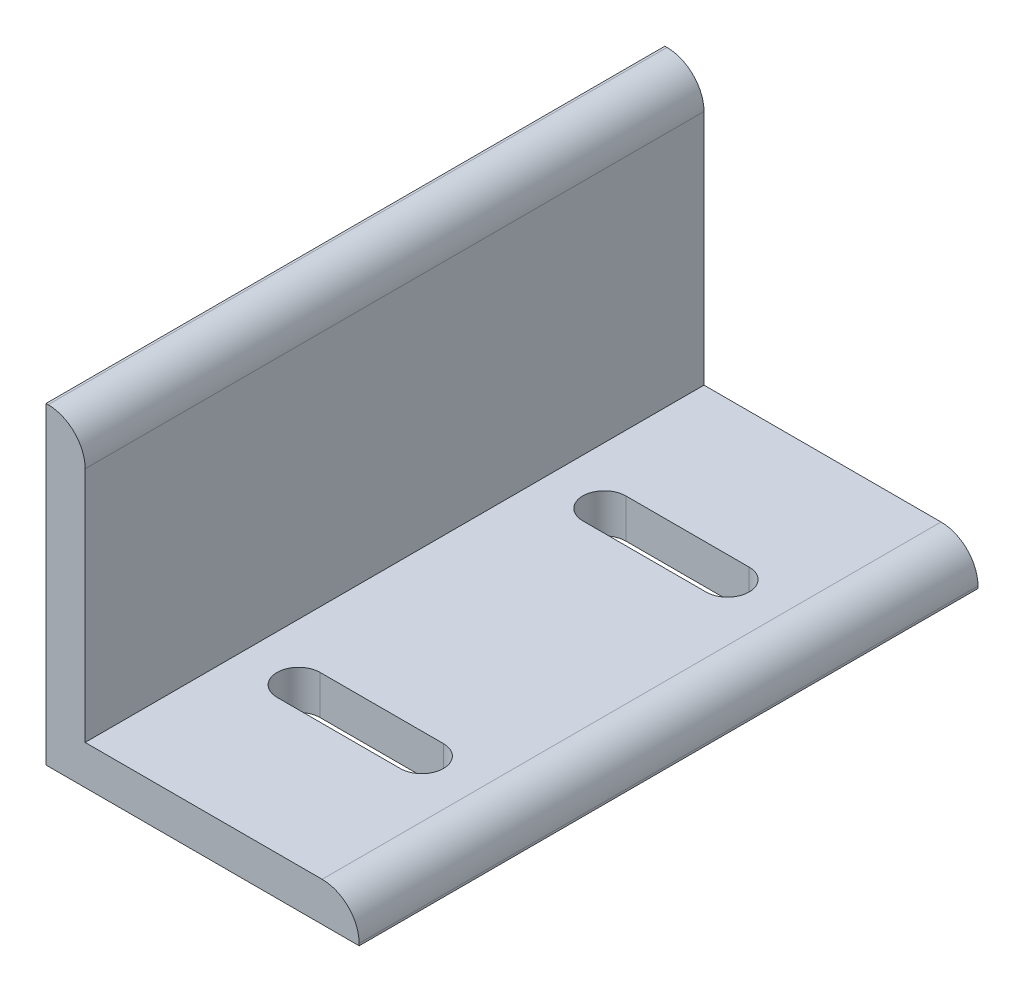
ISO-10303-21;
HEADER;
FILE_DESCRIPTION(('STEP AP214'),'2;1');
FILE_NAME('part.step','',(''),(''),'','','');
FILE_SCHEMA(('AUTOMOTIVE_DESIGN { 1 0 10303 214 1 1 1 1 }'));
ENDSEC;
DATA;
#1=APPLICATION_CONTEXT('core data for automotive mechanical design processes');
#2=APPLICATION_PROTOCOL_DEFINITION('international standard','automotive_design',2000,#1);
#3=PRODUCT_CONTEXT('',#1,'mechanical');
#4=PRODUCT('Part','Part','',(#3));
#5=PRODUCT_RELATED_PRODUCT_CATEGORY('part','',(#4));
#6=PRODUCT_DEFINITION_FORMATION('','',#4);
#7=PRODUCT_DEFINITION_CONTEXT('part definition',#1,'design');
#8=PRODUCT_DEFINITION('design','',#6,#7);
#9=PRODUCT_DEFINITION_SHAPE('','',#8);
#10=(LENGTH_UNIT() NAMED_UNIT(*) SI_UNIT(.MILLI.,.METRE.));
#11=(NAMED_UNIT(*) PLANE_ANGLE_UNIT() SI_UNIT($,.RADIAN.));
#12=(NAMED_UNIT(*) SI_UNIT($,.STERADIAN.) SOLID_ANGLE_UNIT());
#13=UNCERTAINTY_MEASURE_WITH_UNIT(LENGTH_MEASURE(1.E-05),#10,'distance_accuracy_value','');
#14=(GEOMETRIC_REPRESENTATION_CONTEXT(3) GLOBAL_UNCERTAINTY_ASSIGNED_CONTEXT((#13)) GLOBAL_UNIT_ASSIGNED_CONTEXT((#10,
#11,#12)) REPRESENTATION_CONTEXT('',''));
#15=CARTESIAN_POINT('',(0.,0.,0.));
#16=DIRECTION('',(0.,0.,1.));
#17=DIRECTION('',(1.,0.,0.));
#18=AXIS2_PLACEMENT_3D('',#15,#16,#17);
#19=CARTESIAN_POINT('',(0.35,44.8,100.4));
#20=DIRECTION('',(0.,0.,-1.));
#21=DIRECTION('',(-1.,0.,0.));
#22=AXIS2_PLACEMENT_3D('',#19,#20,#21);
#23=CYLINDRICAL_SURFACE('',#22,6.);
#24=CARTESIAN_POINT('',(0.35,44.8,0.));
#25=DIRECTION('',(0.,0.,1.));
#26=DIRECTION('',(1.,0.,0.));
#27=AXIS2_PLACEMENT_3D('',#24,#25,#26);
#28=CIRCLE('',#27,6.);
#29=CARTESIAN_POINT('',(0.35,50.8,0.));
#30=VERTEX_POINT('',#29);
#31=CARTESIAN_POINT('',(6.35,44.8,0.));
#32=VERTEX_POINT('',#31);
#33=EDGE_CURVE('E246',#30,#32,#28,.F.);
#34=ORIENTED_EDGE('',*,*,#33,.F.);
#35=DIRECTION('',(0.,0.,-1.));
#36=VECTOR('',#35,1.);
#37=CARTESIAN_POINT('',(0.35,50.8,100.4));
#38=LINE('',#37,#36);
#39=CARTESIAN_POINT('',(0.35,50.8,100.4));
#40=VERTEX_POINT('',#39);
#41=EDGE_CURVE('E11',#40,#30,#38,.T.);
#42=ORIENTED_EDGE('',*,*,#41,.F.);
#43=CARTESIAN_POINT('',(0.35,44.8,100.4));
#44=DIRECTION('',(0.,0.,1.));
#45=DIRECTION('',(1.,0.,0.));
#46=AXIS2_PLACEMENT_3D('',#43,#44,#45);
#47=CIRCLE('',#46,6.);
#48=CARTESIAN_POINT('',(6.35,44.8,100.4));
#49=VERTEX_POINT('',#48);
#50=EDGE_CURVE('E247',#40,#49,#47,.F.);
#51=ORIENTED_EDGE('',*,*,#50,.T.);
#52=DIRECTION('',(0.,0.,-1.));
#53=VECTOR('',#52,1.);
#54=CARTESIAN_POINT('',(6.35,44.8,100.4));
#55=LINE('',#54,#53);
#56=EDGE_CURVE('E277',#49,#32,#55,.T.);
#57=ORIENTED_EDGE('',*,*,#56,.T.);
#58=EDGE_LOOP('',(#34,#42,#51,#57));
#59=FACE_BOUND('',#58,.T.);
#60=ADVANCED_FACE('F41',(#59),#23,.T.);
#61=CARTESIAN_POINT('',(0.,50.8,100.4));
#62=DIRECTION('',(0.,1.,0.));
#63=DIRECTION('',(0.,0.,1.));
#64=AXIS2_PLACEMENT_3D('',#61,#62,#63);
#65=PLANE('',#64);
#66=DIRECTION('',(1.,0.,0.));
#67=VECTOR('',#66,1.);
#68=CARTESIAN_POINT('',(0.,50.8,0.));
#69=LINE('',#68,#67);
#70=CARTESIAN_POINT('',(0.,50.8,0.));
#71=VERTEX_POINT('',#70);
#72=EDGE_CURVE('E281',#71,#30,#69,.T.);
#73=ORIENTED_EDGE('',*,*,#72,.F.);
#74=DIRECTION('',(0.,0.,-1.));
#75=VECTOR('',#74,1.);
#76=CARTESIAN_POINT('',(0.,50.8,100.4));
#77=LINE('',#76,#75);
#78=CARTESIAN_POINT('',(0.,50.8,100.4));
#79=VERTEX_POINT('',#78);
#80=EDGE_CURVE('E49',#79,#71,#77,.T.);
#81=ORIENTED_EDGE('',*,*,#80,.F.);
#82=DIRECTION('',(1.,0.,0.));
#83=VECTOR('',#82,1.);
#84=CARTESIAN_POINT('',(0.,50.8,100.4));
#85=LINE('',#84,#83);
#86=EDGE_CURVE('E251',#79,#40,#85,.T.);
#87=ORIENTED_EDGE('',*,*,#86,.T.);
#88=ORIENTED_EDGE('',*,*,#41,.T.);
#89=EDGE_LOOP('',(#73,#81,#87,#88));
#90=FACE_BOUND('',#89,.T.);
#91=ADVANCED_FACE('F332',(#90),#65,.T.);
#92=CARTESIAN_POINT('',(0.,0.,100.4));
#93=DIRECTION('',(-1.,0.,0.));
#94=DIRECTION('',(0.,0.,1.));
#95=AXIS2_PLACEMENT_3D('',#92,#93,#94);
#96=PLANE('',#95);
#97=DIRECTION('',(0.,1.,0.));
#98=VECTOR('',#97,1.);
#99=CARTESIAN_POINT('',(0.,0.,0.));
#100=LINE('',#99,#98);
#101=CARTESIAN_POINT('',(0.,0.,0.));
#102=VERTEX_POINT('',#101);
#103=EDGE_CURVE('E285',#102,#71,#100,.T.);
#104=ORIENTED_EDGE('',*,*,#103,.F.);
#105=DIRECTION('',(0.,0.,-1.));
#106=VECTOR('',#105,1.);
#107=CARTESIAN_POINT('',(0.,0.,100.4));
#108=LINE('',#107,#106);
#109=CARTESIAN_POINT('',(0.,0.,100.4));
#110=VERTEX_POINT('',#109);
#111=EDGE_CURVE('E322',#110,#102,#108,.T.);
#112=ORIENTED_EDGE('',*,*,#111,.F.);
#113=DIRECTION('',(0.,1.,0.));
#114=VECTOR('',#113,1.);
#115=CARTESIAN_POINT('',(0.,0.,100.4));
#116=LINE('',#115,#114);
#117=EDGE_CURVE('E256',#110,#79,#116,.T.);
#118=ORIENTED_EDGE('',*,*,#117,.T.);
#119=ORIENTED_EDGE('',*,*,#80,.T.);
#120=EDGE_LOOP('',(#104,#112,#118,#119));
#121=FACE_BOUND('',#120,.T.);
#122=ADVANCED_FACE('F328',(#121),#96,.T.);
#123=CARTESIAN_POINT('',(0.,0.,100.4));
#124=DIRECTION('',(0.,1.,0.));
#125=DIRECTION('',(0.,0.,1.));
#126=AXIS2_PLACEMENT_3D('',#123,#124,#125);
#127=PLANE('',#126);
#128=DIRECTION('',(-1.,0.,0.));
#129=VECTOR('',#128,1.);
#130=CARTESIAN_POINT('',(0.,0.,21.9));
#131=LINE('',#130,#129);
#132=CARTESIAN_POINT('',(35.575,0.,21.9));
#133=VERTEX_POINT('',#132);
#134=CARTESIAN_POINT('',(15.575,0.,21.9));
#135=VERTEX_POINT('',#134);
#136=EDGE_CURVE('E238',#133,#135,#131,.T.);
#137=ORIENTED_EDGE('',*,*,#136,.T.);
#138=CARTESIAN_POINT('',(15.575,0.,25.4));
#139=DIRECTION('',(0.,1.,0.));
#140=DIRECTION('',(0.,0.,1.));
#141=AXIS2_PLACEMENT_3D('',#138,#139,#140);
#142=CIRCLE('',#141,3.5);
#143=CARTESIAN_POINT('',(15.575,0.,28.9));
#144=VERTEX_POINT('',#143);
#145=EDGE_CURVE('E242',#135,#144,#142,.T.);
#146=ORIENTED_EDGE('',*,*,#145,.T.);
#147=DIRECTION('',(1.,0.,0.));
#148=VECTOR('',#147,1.);
#149=CARTESIAN_POINT('',(0.,0.,28.9));
#150=LINE('',#149,#148);
#151=CARTESIAN_POINT('',(35.575,0.,28.9));
#152=VERTEX_POINT('',#151);
#153=EDGE_CURVE('E233',#144,#152,#150,.T.);
#154=ORIENTED_EDGE('',*,*,#153,.T.);
#155=CARTESIAN_POINT('',(35.575,0.,25.4));
#156=DIRECTION('',(0.,1.,0.));
#157=DIRECTION('',(0.,0.,1.));
#158=AXIS2_PLACEMENT_3D('',#155,#156,#157);
#159=CIRCLE('',#158,3.5);
#160=EDGE_CURVE('E158',#152,#133,#159,.T.);
#161=ORIENTED_EDGE('',*,*,#160,.T.);
#162=EDGE_LOOP('',(#137,#146,#154,#161));
#163=FACE_BOUND('',#162,.T.);
#164=DIRECTION('',(-1.,0.,0.));
#165=VECTOR('',#164,1.);
#166=CARTESIAN_POINT('',(0.,0.,71.5));
#167=LINE('',#166,#165);
#168=CARTESIAN_POINT('',(35.575,0.,71.5));
#169=VERTEX_POINT('',#168);
#170=CARTESIAN_POINT('',(15.575,0.,71.5));
#171=VERTEX_POINT('',#170);
#172=EDGE_CURVE('E225',#169,#171,#167,.T.);
#173=ORIENTED_EDGE('',*,*,#172,.T.);
#174=CARTESIAN_POINT('',(15.575,0.,75.));
#175=DIRECTION('',(0.,1.,0.));
#176=DIRECTION('',(0.,0.,1.));
#177=AXIS2_PLACEMENT_3D('',#174,#175,#176);
#178=CIRCLE('',#177,3.5);
#179=CARTESIAN_POINT('',(15.575,0.,78.5));
#180=VERTEX_POINT('',#179);
#181=EDGE_CURVE('E229',#171,#180,#178,.T.);
#182=ORIENTED_EDGE('',*,*,#181,.T.);
#183=DIRECTION('',(1.,0.,0.));
#184=VECTOR('',#183,1.);
#185=CARTESIAN_POINT('',(0.,0.,78.5));
#186=LINE('',#185,#184);
#187=CARTESIAN_POINT('',(35.575,0.,78.5));
#188=VERTEX_POINT('',#187);
#189=EDGE_CURVE('E187',#180,#188,#186,.T.);
#190=ORIENTED_EDGE('',*,*,#189,.T.);
#191=CARTESIAN_POINT('',(35.575,0.,75.));
#192=DIRECTION('',(0.,1.,0.));
#193=DIRECTION('',(0.,0.,1.));
#194=AXIS2_PLACEMENT_3D('',#191,#192,#193);
#195=CIRCLE('',#194,3.5);
#196=EDGE_CURVE('E221',#188,#169,#195,.T.);
#197=ORIENTED_EDGE('',*,*,#196,.T.);
#198=EDGE_LOOP('',(#173,#182,#190,#197));
#199=FACE_BOUND('',#198,.T.);
#200=DIRECTION('',(1.,0.,0.));
#201=VECTOR('',#200,1.);
#202=CARTESIAN_POINT('',(0.,0.,0.));
#203=LINE('',#202,#201);
#204=CARTESIAN_POINT('',(50.8,0.,0.));
#205=VERTEX_POINT('',#204);
#206=EDGE_CURVE('E289',#102,#205,#203,.T.);
#207=ORIENTED_EDGE('',*,*,#206,.T.);
#208=DIRECTION('',(0.,0.,-1.));
#209=VECTOR('',#208,1.);
#210=CARTESIAN_POINT('',(50.8,0.,100.4));
#211=LINE('',#210,#209);
#212=CARTESIAN_POINT('',(50.8,0.,100.4));
#213=VERTEX_POINT('',#212);
#214=EDGE_CURVE('E318',#213,#205,#211,.T.);
#215=ORIENTED_EDGE('',*,*,#214,.F.);
#216=DIRECTION('',(1.,0.,0.));
#217=VECTOR('',#216,1.);
#218=CARTESIAN_POINT('',(0.,0.,100.4));
#219=LINE('',#218,#217);
#220=EDGE_CURVE('E260',#110,#213,#219,.T.);
#221=ORIENTED_EDGE('',*,*,#220,.F.);
#222=ORIENTED_EDGE('',*,*,#111,.T.);
#223=EDGE_LOOP('',(#207,#215,#221,#222));
#224=FACE_BOUND('',#223,.T.);
#225=ADVANCED_FACE('F340',(#163,#199,#224),#127,.F.);
#226=CARTESIAN_POINT('',(50.8,0.,100.4));
#227=DIRECTION('',(-1.,0.,0.));
#228=DIRECTION('',(0.,0.,1.));
#229=AXIS2_PLACEMENT_3D('',#226,#227,#228);
#230=PLANE('',#229);
#231=DIRECTION('',(0.,1.,0.));
#232=VECTOR('',#231,1.);
#233=CARTESIAN_POINT('',(50.8,0.,0.));
#234=LINE('',#233,#232);
#235=CARTESIAN_POINT('',(50.8,0.35,0.));
#236=VERTEX_POINT('',#235);
#237=EDGE_CURVE('E292',#205,#236,#234,.T.);
#238=ORIENTED_EDGE('',*,*,#237,.T.);
#239=DIRECTION('',(0.,0.,-1.));
#240=VECTOR('',#239,1.);
#241=CARTESIAN_POINT('',(50.8,0.35,100.4));
#242=LINE('',#241,#240);
#243=CARTESIAN_POINT('',(50.8,0.35,100.4));
#244=VERTEX_POINT('',#243);
#245=EDGE_CURVE('E315',#244,#236,#242,.T.);
#246=ORIENTED_EDGE('',*,*,#245,.F.);
#247=DIRECTION('',(0.,1.,0.));
#248=VECTOR('',#247,1.);
#249=CARTESIAN_POINT('',(50.8,0.,100.4));
#250=LINE('',#249,#248);
#251=EDGE_CURVE('E263',#213,#244,#250,.T.);
#252=ORIENTED_EDGE('',*,*,#251,.F.);
#253=ORIENTED_EDGE('',*,*,#214,.T.);
#254=EDGE_LOOP('',(#238,#246,#252,#253));
#255=FACE_BOUND('',#254,.T.);
#256=ADVANCED_FACE('F344',(#255),#230,.F.);
#257=CARTESIAN_POINT('',(44.8,0.35,100.4));
#258=DIRECTION('',(0.,0.,-1.));
#259=DIRECTION('',(-1.,0.,0.));
#260=AXIS2_PLACEMENT_3D('',#257,#258,#259);
#261=CYLINDRICAL_SURFACE('',#260,6.);
#262=CARTESIAN_POINT('',(44.8,0.35,0.));
#263=DIRECTION('',(0.,0.,1.));
#264=DIRECTION('',(1.,0.,0.));
#265=AXIS2_PLACEMENT_3D('',#262,#263,#264);
#266=CIRCLE('',#265,6.);
#267=CARTESIAN_POINT('',(44.8,6.35,0.));
#268=VERTEX_POINT('',#267);
#269=EDGE_CURVE('E296',#268,#236,#266,.F.);
#270=ORIENTED_EDGE('',*,*,#269,.F.);
#271=DIRECTION('',(0.,0.,-1.));
#272=VECTOR('',#271,1.);
#273=CARTESIAN_POINT('',(44.8,6.35,100.4));
#274=LINE('',#273,#272);
#275=CARTESIAN_POINT('',(44.8,6.35,100.4));
#276=VERTEX_POINT('',#275);
#277=EDGE_CURVE('E312',#276,#268,#274,.T.);
#278=ORIENTED_EDGE('',*,*,#277,.F.);
#279=CARTESIAN_POINT('',(44.8,0.35,100.4));
#280=DIRECTION('',(0.,0.,1.));
#281=DIRECTION('',(1.,0.,0.));
#282=AXIS2_PLACEMENT_3D('',#279,#280,#281);
#283=CIRCLE('',#282,6.);
#284=EDGE_CURVE('E266',#276,#244,#283,.F.);
#285=ORIENTED_EDGE('',*,*,#284,.T.);
#286=ORIENTED_EDGE('',*,*,#245,.T.);
#287=EDGE_LOOP('',(#270,#278,#285,#286));
#288=FACE_BOUND('',#287,.T.);
#289=ADVANCED_FACE('F360',(#288),#261,.T.);
#290=CARTESIAN_POINT('',(0.,6.35,100.4));
#291=DIRECTION('',(0.,1.,0.));
#292=DIRECTION('',(0.,0.,1.));
#293=AXIS2_PLACEMENT_3D('',#290,#291,#292);
#294=PLANE('',#293);
#295=CARTESIAN_POINT('',(15.575,6.35,25.4));
#296=DIRECTION('',(0.,1.,0.));
#297=DIRECTION('',(0.,0.,1.));
#298=AXIS2_PLACEMENT_3D('',#295,#296,#297);
#299=CIRCLE('',#298,3.5);
#300=CARTESIAN_POINT('',(15.575,6.35,21.9));
#301=VERTEX_POINT('',#300);
#302=CARTESIAN_POINT('',(15.575,6.35,28.9));
#303=VERTEX_POINT('',#302);
#304=EDGE_CURVE('E172',#301,#303,#299,.T.);
#305=ORIENTED_EDGE('',*,*,#304,.F.);
#306=DIRECTION('',(-1.,0.,0.));
#307=VECTOR('',#306,1.);
#308=CARTESIAN_POINT('',(15.575,6.35,21.9));
#309=LINE('',#308,#307);
#310=CARTESIAN_POINT('',(35.575,6.35,21.9));
#311=VERTEX_POINT('',#310);
#312=EDGE_CURVE('E177',#311,#301,#309,.T.);
#313=ORIENTED_EDGE('',*,*,#312,.F.);
#314=CARTESIAN_POINT('',(35.575,6.35,25.4));
#315=DIRECTION('',(0.,1.,0.));
#316=DIRECTION('',(0.,0.,1.));
#317=AXIS2_PLACEMENT_3D('',#314,#315,#316);
#318=CIRCLE('',#317,3.5);
#319=CARTESIAN_POINT('',(35.575,6.35,28.9));
#320=VERTEX_POINT('',#319);
#321=EDGE_CURVE('E155',#320,#311,#318,.T.);
#322=ORIENTED_EDGE('',*,*,#321,.F.);
#323=DIRECTION('',(1.,0.,0.));
#324=VECTOR('',#323,1.);
#325=CARTESIAN_POINT('',(15.575,6.35,28.9));
#326=LINE('',#325,#324);
#327=EDGE_CURVE('E166',#303,#320,#326,.T.);
#328=ORIENTED_EDGE('',*,*,#327,.F.);
#329=EDGE_LOOP('',(#305,#313,#322,#328));
#330=FACE_BOUND('',#329,.T.);
#331=CARTESIAN_POINT('',(15.575,6.35,75.));
#332=DIRECTION('',(0.,1.,0.));
#333=DIRECTION('',(0.,0.,-1.));
#334=AXIS2_PLACEMENT_3D('',#331,#332,#333);
#335=CIRCLE('',#334,3.5);
#336=CARTESIAN_POINT('',(15.575,6.35,71.5));
#337=VERTEX_POINT('',#336);
#338=CARTESIAN_POINT('',(15.575,6.35,78.5));
#339=VERTEX_POINT('',#338);
#340=EDGE_CURVE('E192',#337,#339,#335,.T.);
#341=ORIENTED_EDGE('',*,*,#340,.F.);
#342=DIRECTION('',(-1.,0.,0.));
#343=VECTOR('',#342,1.);
#344=CARTESIAN_POINT('',(15.575,6.35,71.5));
#345=LINE('',#344,#343);
#346=CARTESIAN_POINT('',(35.575,6.35,71.5));
#347=VERTEX_POINT('',#346);
#348=EDGE_CURVE('E202',#347,#337,#345,.T.);
#349=ORIENTED_EDGE('',*,*,#348,.F.);
#350=CARTESIAN_POINT('',(35.575,6.35,75.));
#351=DIRECTION('',(0.,1.,0.));
#352=DIRECTION('',(0.,0.,-1.));
#353=AXIS2_PLACEMENT_3D('',#350,#351,#352);
#354=CIRCLE('',#353,3.5);
#355=CARTESIAN_POINT('',(35.575,6.35,78.5));
#356=VERTEX_POINT('',#355);
#357=EDGE_CURVE('E198',#356,#347,#354,.T.);
#358=ORIENTED_EDGE('',*,*,#357,.F.);
#359=DIRECTION('',(1.,0.,0.));
#360=VECTOR('',#359,1.);
#361=CARTESIAN_POINT('',(15.575,6.35,78.5));
#362=LINE('',#361,#360);
#363=EDGE_CURVE('E195',#339,#356,#362,.T.);
#364=ORIENTED_EDGE('',*,*,#363,.F.);
#365=EDGE_LOOP('',(#341,#349,#358,#364));
#366=FACE_BOUND('',#365,.T.);
#367=DIRECTION('',(1.,0.,0.));
#368=VECTOR('',#367,1.);
#369=CARTESIAN_POINT('',(0.,6.35,0.));
#370=LINE('',#369,#368);
#371=CARTESIAN_POINT('',(6.35,6.35,0.));
#372=VERTEX_POINT('',#371);
#373=EDGE_CURVE('E300',#372,#268,#370,.T.);
#374=ORIENTED_EDGE('',*,*,#373,.F.);
#375=DIRECTION('',(0.,0.,-1.));
#376=VECTOR('',#375,1.);
#377=CARTESIAN_POINT('',(6.35,6.35,100.4));
#378=LINE('',#377,#376);
#379=CARTESIAN_POINT('',(6.35,6.35,100.4));
#380=VERTEX_POINT('',#379);
#381=EDGE_CURVE('E309',#380,#372,#378,.T.);
#382=ORIENTED_EDGE('',*,*,#381,.F.);
#383=DIRECTION('',(1.,0.,0.));
#384=VECTOR('',#383,1.);
#385=CARTESIAN_POINT('',(0.,6.35,100.4));
#386=LINE('',#385,#384);
#387=EDGE_CURVE('E270',#380,#276,#386,.T.);
#388=ORIENTED_EDGE('',*,*,#387,.T.);
#389=ORIENTED_EDGE('',*,*,#277,.T.);
#390=EDGE_LOOP('',(#374,#382,#388,#389));
#391=FACE_BOUND('',#390,.T.);
#392=ADVANCED_FACE('F174',(#330,#366,#391),#294,.T.);
#393=CARTESIAN_POINT('',(6.35,0.,100.4));
#394=DIRECTION('',(-1.,0.,0.));
#395=DIRECTION('',(0.,-1.,0.));
#396=AXIS2_PLACEMENT_3D('',#393,#394,#395);
#397=PLANE('',#396);
#398=DIRECTION('',(0.,1.,0.));
#399=VECTOR('',#398,1.);
#400=CARTESIAN_POINT('',(6.35,0.,0.));
#401=LINE('',#400,#399);
#402=EDGE_CURVE('E252',#372,#32,#401,.T.);
#403=ORIENTED_EDGE('',*,*,#402,.T.);
#404=ORIENTED_EDGE('',*,*,#56,.F.);
#405=DIRECTION('',(0.,1.,0.));
#406=VECTOR('',#405,1.);
#407=CARTESIAN_POINT('',(6.35,0.,100.4));
#408=LINE('',#407,#406);
#409=EDGE_CURVE('E274',#380,#49,#408,.T.);
#410=ORIENTED_EDGE('',*,*,#409,.F.);
#411=ORIENTED_EDGE('',*,*,#381,.T.);
#412=EDGE_LOOP('',(#403,#404,#410,#411));
#413=FACE_BOUND('',#412,.T.);
#414=ADVANCED_FACE('F367',(#413),#397,.F.);
#415=CARTESIAN_POINT('',(0.,0.,100.4));
#416=DIRECTION('',(0.,0.,1.));
#417=DIRECTION('',(1.,0.,0.));
#418=AXIS2_PLACEMENT_3D('',#415,#416,#417);
#419=PLANE('',#418);
#420=ORIENTED_EDGE('',*,*,#50,.F.);
#421=ORIENTED_EDGE('',*,*,#86,.F.);
#422=ORIENTED_EDGE('',*,*,#117,.F.);
#423=ORIENTED_EDGE('',*,*,#220,.T.);
#424=ORIENTED_EDGE('',*,*,#251,.T.);
#425=ORIENTED_EDGE('',*,*,#284,.F.);
#426=ORIENTED_EDGE('',*,*,#387,.F.);
#427=ORIENTED_EDGE('',*,*,#409,.T.);
#428=EDGE_LOOP('',(#420,#421,#422,#423,#424,#425,#426,#427));
#429=FACE_BOUND('',#428,.T.);
#430=ADVANCED_FACE('F349',(#429),#419,.T.);
#431=CARTESIAN_POINT('',(0.,0.,0.));
#432=DIRECTION('',(0.,0.,1.));
#433=DIRECTION('',(1.,0.,0.));
#434=AXIS2_PLACEMENT_3D('',#431,#432,#433);
#435=PLANE('',#434);
#436=ORIENTED_EDGE('',*,*,#33,.T.);
#437=ORIENTED_EDGE('',*,*,#402,.F.);
#438=ORIENTED_EDGE('',*,*,#373,.T.);
#439=ORIENTED_EDGE('',*,*,#269,.T.);
#440=ORIENTED_EDGE('',*,*,#237,.F.);
#441=ORIENTED_EDGE('',*,*,#206,.F.);
#442=ORIENTED_EDGE('',*,*,#103,.T.);
#443=ORIENTED_EDGE('',*,*,#72,.T.);
#444=EDGE_LOOP('',(#436,#437,#438,#439,#440,#441,#442,#443));
#445=FACE_BOUND('',#444,.T.);
#446=ADVANCED_FACE('F336',(#445),#435,.F.);
#447=CARTESIAN_POINT('',(15.575,-3.65,75.));
#448=DIRECTION('',(0.,1.,0.));
#449=DIRECTION('',(0.,0.,1.));
#450=AXIS2_PLACEMENT_3D('',#447,#448,#449);
#451=CYLINDRICAL_SURFACE('',#450,3.5);
#452=DIRECTION('',(0.,1.,0.));
#453=VECTOR('',#452,1.);
#454=CARTESIAN_POINT('',(15.575,-3.65,71.5));
#455=LINE('',#454,#453);
#456=EDGE_CURVE('E207',#171,#337,#455,.T.);
#457=ORIENTED_EDGE('',*,*,#456,.T.);
#458=ORIENTED_EDGE('',*,*,#340,.T.);
#459=DIRECTION('',(0.,1.,0.));
#460=VECTOR('',#459,1.);
#461=CARTESIAN_POINT('',(15.575,-3.65,78.5));
#462=LINE('',#461,#460);
#463=EDGE_CURVE('E206',#180,#339,#462,.T.);
#464=ORIENTED_EDGE('',*,*,#463,.F.);
#465=ORIENTED_EDGE('',*,*,#181,.F.);
#466=EDGE_LOOP('',(#457,#458,#464,#465));
#467=FACE_BOUND('',#466,.T.);
#468=ADVANCED_FACE('F396',(#467),#451,.F.);
#469=CARTESIAN_POINT('',(15.575,-3.65,71.5));
#470=DIRECTION('',(0.,0.,-1.));
#471=DIRECTION('',(-1.,0.,0.));
#472=AXIS2_PLACEMENT_3D('',#469,#470,#471);
#473=PLANE('',#472);
#474=DIRECTION('',(0.,1.,0.));
#475=VECTOR('',#474,1.);
#476=CARTESIAN_POINT('',(35.575,-3.65,71.5));
#477=LINE('',#476,#475);
#478=EDGE_CURVE('E210',#169,#347,#477,.T.);
#479=ORIENTED_EDGE('',*,*,#478,.T.);
#480=ORIENTED_EDGE('',*,*,#348,.T.);
#481=ORIENTED_EDGE('',*,*,#456,.F.);
#482=ORIENTED_EDGE('',*,*,#172,.F.);
#483=EDGE_LOOP('',(#479,#480,#481,#482));
#484=FACE_BOUND('',#483,.T.);
#485=ADVANCED_FACE('F387',(#484),#473,.F.);
#486=CARTESIAN_POINT('',(35.575,-3.65,75.));
#487=DIRECTION('',(0.,1.,0.));
#488=DIRECTION('',(0.,0.,1.));
#489=AXIS2_PLACEMENT_3D('',#486,#487,#488);
#490=CYLINDRICAL_SURFACE('',#489,3.5);
#491=DIRECTION('',(0.,1.,0.));
#492=VECTOR('',#491,1.);
#493=CARTESIAN_POINT('',(35.575,-3.65,78.5));
#494=LINE('',#493,#492);
#495=EDGE_CURVE('E64',#188,#356,#494,.T.);
#496=ORIENTED_EDGE('',*,*,#495,.T.);
#497=ORIENTED_EDGE('',*,*,#357,.T.);
#498=ORIENTED_EDGE('',*,*,#478,.F.);
#499=ORIENTED_EDGE('',*,*,#196,.F.);
#500=EDGE_LOOP('',(#496,#497,#498,#499));
#501=FACE_BOUND('',#500,.T.);
#502=ADVANCED_FACE('F389',(#501),#490,.F.);
#503=CARTESIAN_POINT('',(15.575,-3.65,78.5));
#504=DIRECTION('',(0.,0.,1.));
#505=DIRECTION('',(1.,0.,0.));
#506=AXIS2_PLACEMENT_3D('',#503,#504,#505);
#507=PLANE('',#506);
#508=ORIENTED_EDGE('',*,*,#463,.T.);
#509=ORIENTED_EDGE('',*,*,#363,.T.);
#510=ORIENTED_EDGE('',*,*,#495,.F.);
#511=ORIENTED_EDGE('',*,*,#189,.F.);
#512=EDGE_LOOP('',(#508,#509,#510,#511));
#513=FACE_BOUND('',#512,.T.);
#514=ADVANCED_FACE('F397',(#513),#507,.F.);
#515=CARTESIAN_POINT('',(15.575,-3.65,25.4));
#516=DIRECTION('',(0.,1.,0.));
#517=DIRECTION('',(0.,0.,1.));
#518=AXIS2_PLACEMENT_3D('',#515,#516,#517);
#519=CYLINDRICAL_SURFACE('',#518,3.5);
#520=DIRECTION('',(0.,1.,0.));
#521=VECTOR('',#520,1.);
#522=CARTESIAN_POINT('',(15.575,-3.65,21.9));
#523=LINE('',#522,#521);
#524=EDGE_CURVE('E184',#135,#301,#523,.T.);
#525=ORIENTED_EDGE('',*,*,#524,.T.);
#526=ORIENTED_EDGE('',*,*,#304,.T.);
#527=DIRECTION('',(0.,1.,0.));
#528=VECTOR('',#527,1.);
#529=CARTESIAN_POINT('',(15.575,-3.65,28.9));
#530=LINE('',#529,#528);
#531=EDGE_CURVE('E162',#144,#303,#530,.T.);
#532=ORIENTED_EDGE('',*,*,#531,.F.);
#533=ORIENTED_EDGE('',*,*,#145,.F.);
#534=EDGE_LOOP('',(#525,#526,#532,#533));
#535=FACE_BOUND('',#534,.T.);
#536=ADVANCED_FACE('F399',(#535),#519,.F.);
#537=CARTESIAN_POINT('',(15.575,-3.65,21.9));
#538=DIRECTION('',(0.,0.,-1.));
#539=DIRECTION('',(-1.,0.,0.));
#540=AXIS2_PLACEMENT_3D('',#537,#538,#539);
#541=PLANE('',#540);
#542=DIRECTION('',(0.,1.,0.));
#543=VECTOR('',#542,1.);
#544=CARTESIAN_POINT('',(35.575,-3.65,21.9));
#545=LINE('',#544,#543);
#546=EDGE_CURVE('E161',#133,#311,#545,.T.);
#547=ORIENTED_EDGE('',*,*,#546,.T.);
#548=ORIENTED_EDGE('',*,*,#312,.T.);
#549=ORIENTED_EDGE('',*,*,#524,.F.);
#550=ORIENTED_EDGE('',*,*,#136,.F.);
#551=EDGE_LOOP('',(#547,#548,#549,#550));
#552=FACE_BOUND('',#551,.T.);
#553=ADVANCED_FACE('F405',(#552),#541,.F.);
#554=CARTESIAN_POINT('',(35.575,-3.65,25.4));
#555=DIRECTION('',(0.,1.,0.));
#556=DIRECTION('',(0.,0.,1.));
#557=AXIS2_PLACEMENT_3D('',#554,#555,#556);
#558=CYLINDRICAL_SURFACE('',#557,3.5);
#559=DIRECTION('',(0.,1.,0.));
#560=VECTOR('',#559,1.);
#561=CARTESIAN_POINT('',(35.575,-3.65,28.9));
#562=LINE('',#561,#560);
#563=EDGE_CURVE('E56',#152,#320,#562,.T.);
#564=ORIENTED_EDGE('',*,*,#563,.T.);
#565=ORIENTED_EDGE('',*,*,#321,.T.);
#566=ORIENTED_EDGE('',*,*,#546,.F.);
#567=ORIENTED_EDGE('',*,*,#160,.F.);
#568=EDGE_LOOP('',(#564,#565,#566,#567));
#569=FACE_BOUND('',#568,.T.);
#570=ADVANCED_FACE('F152',(#569),#558,.F.);
#571=CARTESIAN_POINT('',(15.575,-3.65,28.9));
#572=DIRECTION('',(0.,0.,1.));
#573=DIRECTION('',(1.,0.,0.));
#574=AXIS2_PLACEMENT_3D('',#571,#572,#573);
#575=PLANE('',#574);
#576=ORIENTED_EDGE('',*,*,#531,.T.);
#577=ORIENTED_EDGE('',*,*,#327,.T.);
#578=ORIENTED_EDGE('',*,*,#563,.F.);
#579=ORIENTED_EDGE('',*,*,#153,.F.);
#580=EDGE_LOOP('',(#576,#577,#578,#579));
#581=FACE_BOUND('',#580,.T.);
#582=ADVANCED_FACE('F167',(#581),#575,.F.);
#583=CLOSED_SHELL('',(#60,#91,#122,#225,#256,#289,#392,#414,#430,#446,#468,#485,#502,#514,#536,
#553,#570,#582));
#584=MANIFOLD_SOLID_BREP('B2',#583);
#585=ADVANCED_BREP_SHAPE_REPRESENTATION('',(#18,#584),#14);
#586=SHAPE_DEFINITION_REPRESENTATION(#9,#585);
ENDSEC;
END-ISO-10303-21;
